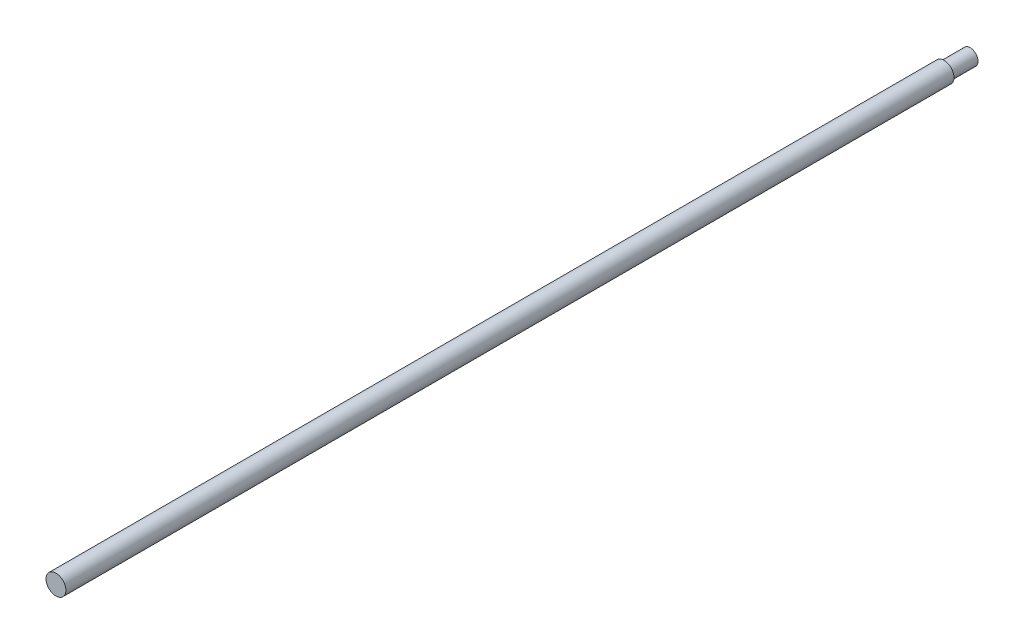
ISO-10303-21;
HEADER;
FILE_DESCRIPTION(('STEP AP214'),'2;1');
FILE_NAME('part.step','',(''),(''),'','','');
FILE_SCHEMA(('AUTOMOTIVE_DESIGN { 1 0 10303 214 1 1 1 1 }'));
ENDSEC;
DATA;
#1=APPLICATION_CONTEXT('core data for automotive mechanical design processes');
#2=APPLICATION_PROTOCOL_DEFINITION('international standard','automotive_design',2000,#1);
#3=PRODUCT_CONTEXT('',#1,'mechanical');
#4=PRODUCT('Part','Part','',(#3));
#5=PRODUCT_RELATED_PRODUCT_CATEGORY('part','',(#4));
#6=PRODUCT_DEFINITION_FORMATION('','',#4);
#7=PRODUCT_DEFINITION_CONTEXT('part definition',#1,'design');
#8=PRODUCT_DEFINITION('design','',#6,#7);
#9=PRODUCT_DEFINITION_SHAPE('','',#8);
#10=(LENGTH_UNIT() NAMED_UNIT(*) SI_UNIT(.MILLI.,.METRE.));
#11=(NAMED_UNIT(*) PLANE_ANGLE_UNIT() SI_UNIT($,.RADIAN.));
#12=(NAMED_UNIT(*) SI_UNIT($,.STERADIAN.) SOLID_ANGLE_UNIT());
#13=UNCERTAINTY_MEASURE_WITH_UNIT(LENGTH_MEASURE(1.E-05),#10,'distance_accuracy_value','');
#14=(GEOMETRIC_REPRESENTATION_CONTEXT(3) GLOBAL_UNCERTAINTY_ASSIGNED_CONTEXT((#13)) GLOBAL_UNIT_ASSIGNED_CONTEXT((#10,
#11,#12)) REPRESENTATION_CONTEXT('',''));
#15=CARTESIAN_POINT('',(0.,0.,0.));
#16=DIRECTION('',(0.,0.,1.));
#17=DIRECTION('',(1.,0.,0.));
#18=AXIS2_PLACEMENT_3D('',#15,#16,#17);
#19=CARTESIAN_POINT('',(0.,0.,350.));
#20=DIRECTION('',(0.,0.,-1.));
#21=DIRECTION('',(-1.,0.,0.));
#22=AXIS2_PLACEMENT_3D('',#19,#20,#21);
#23=CYLINDRICAL_SURFACE('',#22,3.8);
#24=CARTESIAN_POINT('',(0.,0.,350.));
#25=DIRECTION('',(0.,0.,1.));
#26=DIRECTION('',(1.,0.,0.));
#27=AXIS2_PLACEMENT_3D('',#24,#25,#26);
#28=CIRCLE('',#27,3.8);
#29=CARTESIAN_POINT('',(3.8,0.,350.));
#30=VERTEX_POINT('',#29);
#31=EDGE_CURVE('E11',#30,#30,#28,.T.);
#32=ORIENTED_EDGE('',*,*,#31,.F.);
#33=EDGE_LOOP('',(#32));
#34=FACE_BOUND('',#33,.T.);
#35=CARTESIAN_POINT('',(0.,0.,10.));
#36=DIRECTION('',(0.,0.,-1.));
#37=DIRECTION('',(-1.,0.,0.));
#38=AXIS2_PLACEMENT_3D('',#35,#36,#37);
#39=CIRCLE('',#38,3.8);
#40=CARTESIAN_POINT('',(-3.8,0.,10.));
#41=VERTEX_POINT('',#40);
#42=EDGE_CURVE('E37',#41,#41,#39,.T.);
#43=ORIENTED_EDGE('',*,*,#42,.F.);
#44=EDGE_LOOP('',(#43));
#45=FACE_BOUND('',#44,.T.);
#46=ADVANCED_FACE('F34',(#34,#45),#23,.T.);
#47=CARTESIAN_POINT('',(0.,0.,350.));
#48=DIRECTION('',(0.,0.,1.));
#49=DIRECTION('',(1.,0.,0.));
#50=AXIS2_PLACEMENT_3D('',#47,#48,#49);
#51=PLANE('',#50);
#52=ORIENTED_EDGE('',*,*,#31,.T.);
#53=EDGE_LOOP('',(#52));
#54=FACE_BOUND('',#53,.T.);
#55=ADVANCED_FACE('F58',(#54),#51,.T.);
#56=CARTESIAN_POINT('',(0.,0.,10.));
#57=DIRECTION('',(0.,0.,-1.));
#58=DIRECTION('',(-1.,0.,0.));
#59=AXIS2_PLACEMENT_3D('',#56,#57,#58);
#60=PLANE('',#59);
#61=CARTESIAN_POINT('',(0.,0.,10.));
#62=DIRECTION('',(0.,0.,-1.));
#63=DIRECTION('',(-1.,0.,0.));
#64=AXIS2_PLACEMENT_3D('',#61,#62,#63);
#65=CIRCLE('',#64,3.);
#66=CARTESIAN_POINT('',(-3.,0.,10.));
#67=VERTEX_POINT('',#66);
#68=EDGE_CURVE('E44',#67,#67,#65,.T.);
#69=ORIENTED_EDGE('',*,*,#68,.F.);
#70=EDGE_LOOP('',(#69));
#71=FACE_BOUND('',#70,.T.);
#72=ORIENTED_EDGE('',*,*,#42,.T.);
#73=EDGE_LOOP('',(#72));
#74=FACE_BOUND('',#73,.T.);
#75=ADVANCED_FACE('F55',(#71,#74),#60,.T.);
#76=CARTESIAN_POINT('',(0.,0.,10.));
#77=DIRECTION('',(0.,0.,-1.));
#78=DIRECTION('',(-1.,0.,0.));
#79=AXIS2_PLACEMENT_3D('',#76,#77,#78);
#80=CYLINDRICAL_SURFACE('',#79,3.);
#81=ORIENTED_EDGE('',*,*,#68,.T.);
#82=EDGE_LOOP('',(#81));
#83=FACE_BOUND('',#82,.T.);
#84=CARTESIAN_POINT('',(0.,0.,0.));
#85=DIRECTION('',(0.,0.,-1.));
#86=DIRECTION('',(-1.,0.,0.));
#87=AXIS2_PLACEMENT_3D('',#84,#85,#86);
#88=CIRCLE('',#87,3.);
#89=CARTESIAN_POINT('',(-3.,0.,0.));
#90=VERTEX_POINT('',#89);
#91=EDGE_CURVE('E46',#90,#90,#88,.T.);
#92=ORIENTED_EDGE('',*,*,#91,.F.);
#93=EDGE_LOOP('',(#92));
#94=FACE_BOUND('',#93,.T.);
#95=ADVANCED_FACE('F52',(#83,#94),#80,.T.);
#96=CARTESIAN_POINT('',(0.,0.,0.));
#97=DIRECTION('',(0.,0.,1.));
#98=DIRECTION('',(1.,0.,0.));
#99=AXIS2_PLACEMENT_3D('',#96,#97,#98);
#100=PLANE('',#99);
#101=ORIENTED_EDGE('',*,*,#91,.T.);
#102=EDGE_LOOP('',(#101));
#103=FACE_BOUND('',#102,.T.);
#104=ADVANCED_FACE('F71',(#103),#100,.F.);
#105=CLOSED_SHELL('',(#46,#55,#75,#95,#104));
#106=MANIFOLD_SOLID_BREP('B2',#105);
#107=ADVANCED_BREP_SHAPE_REPRESENTATION('',(#18,#106),#14);
#108=SHAPE_DEFINITION_REPRESENTATION(#9,#107);
ENDSEC;
END-ISO-10303-21;
